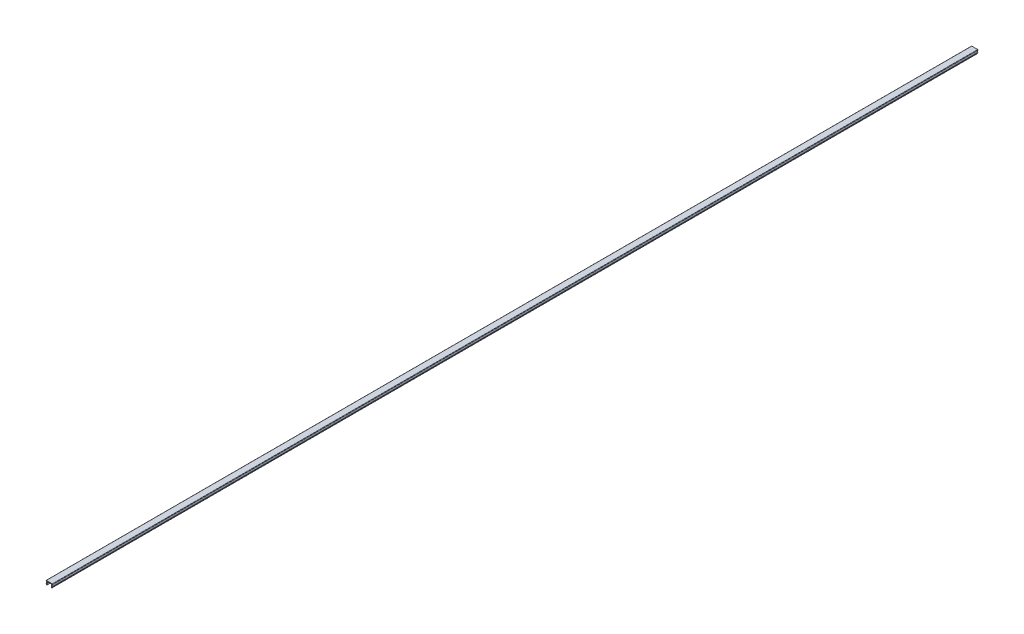
ISO-10303-21;
HEADER;
FILE_DESCRIPTION(('STEP AP214'),'2;1');
FILE_NAME('part.step','',(''),(''),'','','');
FILE_SCHEMA(('AUTOMOTIVE_DESIGN { 1 0 10303 214 1 1 1 1 }'));
ENDSEC;
DATA;
#1=APPLICATION_CONTEXT('core data for automotive mechanical design processes');
#2=APPLICATION_PROTOCOL_DEFINITION('international standard','automotive_design',2000,#1);
#3=PRODUCT_CONTEXT('',#1,'mechanical');
#4=PRODUCT('Part','Part','',(#3));
#5=PRODUCT_RELATED_PRODUCT_CATEGORY('part','',(#4));
#6=PRODUCT_DEFINITION_FORMATION('','',#4);
#7=PRODUCT_DEFINITION_CONTEXT('part definition',#1,'design');
#8=PRODUCT_DEFINITION('design','',#6,#7);
#9=PRODUCT_DEFINITION_SHAPE('','',#8);
#10=(LENGTH_UNIT() NAMED_UNIT(*) SI_UNIT(.MILLI.,.METRE.));
#11=(NAMED_UNIT(*) PLANE_ANGLE_UNIT() SI_UNIT($,.RADIAN.));
#12=(NAMED_UNIT(*) SI_UNIT($,.STERADIAN.) SOLID_ANGLE_UNIT());
#13=UNCERTAINTY_MEASURE_WITH_UNIT(LENGTH_MEASURE(1.E-05),#10,'distance_accuracy_value','');
#14=(GEOMETRIC_REPRESENTATION_CONTEXT(3) GLOBAL_UNCERTAINTY_ASSIGNED_CONTEXT((#13)) GLOBAL_UNIT_ASSIGNED_CONTEXT((#10,
#11,#12)) REPRESENTATION_CONTEXT('',''));
#15=CARTESIAN_POINT('',(0.,0.,0.));
#16=DIRECTION('',(0.,0.,1.));
#17=DIRECTION('',(1.,0.,0.));
#18=AXIS2_PLACEMENT_3D('',#15,#16,#17);
#19=CARTESIAN_POINT('',(-1.62833862518597,3.54999984480356,1000.));
#20=DIRECTION('',(0.,1.,0.));
#21=DIRECTION('',(0.,0.,1.));
#22=AXIS2_PLACEMENT_3D('',#19,#20,#21);
#23=PLANE('',#22);
#24=DIRECTION('',(0.,0.,-1.));
#25=VECTOR('',#24,1.);
#26=CARTESIAN_POINT('',(4.17268348863716,3.54999984480356,1000.));
#27=LINE('',#26,#25);
#28=CARTESIAN_POINT('',(4.17268348863716,3.54999984480356,1000.));
#29=VERTEX_POINT('',#28);
#30=CARTESIAN_POINT('',(4.17268348863716,3.54999984480356,0.));
#31=VERTEX_POINT('',#30);
#32=EDGE_CURVE('E161',#29,#31,#27,.T.);
#33=ORIENTED_EDGE('',*,*,#32,.F.);
#34=DIRECTION('',(1.,0.,0.));
#35=VECTOR('',#34,1.);
#36=CARTESIAN_POINT('',(-1.62833862518597,3.54999984480356,1000.));
#37=LINE('',#36,#35);
#38=CARTESIAN_POINT('',(-0.4293607390091,3.54999984480356,1000.));
#39=VERTEX_POINT('',#38);
#40=EDGE_CURVE('E231',#39,#29,#37,.T.);
#41=ORIENTED_EDGE('',*,*,#40,.F.);
#42=DIRECTION('',(0.,0.,-1.));
#43=VECTOR('',#42,1.);
#44=CARTESIAN_POINT('',(-0.4293607390091,3.54999984480356,1000.));
#45=LINE('',#44,#43);
#46=CARTESIAN_POINT('',(-0.4293607390091,3.54999984480356,0.));
#47=VERTEX_POINT('',#46);
#48=EDGE_CURVE('E244',#39,#47,#45,.T.);
#49=ORIENTED_EDGE('',*,*,#48,.T.);
#50=DIRECTION('',(1.,0.,0.));
#51=VECTOR('',#50,1.);
#52=CARTESIAN_POINT('',(-1.62833862518597,3.54999984480356,0.));
#53=LINE('',#52,#51);
#54=EDGE_CURVE('E239',#47,#31,#53,.T.);
#55=ORIENTED_EDGE('',*,*,#54,.T.);
#56=EDGE_LOOP('',(#33,#41,#49,#55));
#57=FACE_BOUND('',#56,.T.);
#58=ADVANCED_FACE('F15',(#57),#23,.F.);
#59=CARTESIAN_POINT('',(-1.32833862518597,3.54999984480356,1000.));
#60=VERTEX_POINT('',#59);
#61=CARTESIAN_POINT('',(-1.03981651136284,3.54999984480356,1000.));
#62=VERTEX_POINT('',#61);
#63=EDGE_CURVE('E228',#60,#62,#37,.T.);
#64=ORIENTED_EDGE('',*,*,#63,.F.);
#65=DIRECTION('',(0.,0.,-1.));
#66=VECTOR('',#65,1.);
#67=CARTESIAN_POINT('',(-1.32833862518597,3.54999984480356,0.));
#68=LINE('',#67,#66);
#69=CARTESIAN_POINT('',(-1.32833862518597,3.54999984480356,0.));
#70=VERTEX_POINT('',#69);
#71=EDGE_CURVE('E24',#60,#70,#68,.T.);
#72=ORIENTED_EDGE('',*,*,#71,.T.);
#73=CARTESIAN_POINT('',(-1.03981651136284,3.54999984480356,0.));
#74=VERTEX_POINT('',#73);
#75=EDGE_CURVE('E236',#70,#74,#53,.T.);
#76=ORIENTED_EDGE('',*,*,#75,.T.);
#77=DIRECTION('',(0.,0.,-1.));
#78=VECTOR('',#77,1.);
#79=CARTESIAN_POINT('',(-1.03981651136284,3.54999984480356,1000.));
#80=LINE('',#79,#78);
#81=EDGE_CURVE('E235',#62,#74,#80,.T.);
#82=ORIENTED_EDGE('',*,*,#81,.F.);
#83=EDGE_LOOP('',(#64,#72,#76,#82));
#84=FACE_BOUND('',#83,.T.);
#85=ADVANCED_FACE('F317',(#84),#23,.F.);
#86=CARTESIAN_POINT('',(4.7831392609909,3.54999984480356,0.));
#87=VERTEX_POINT('',#86);
#88=CARTESIAN_POINT('',(5.07166137481403,3.54999984480356,0.));
#89=VERTEX_POINT('',#88);
#90=EDGE_CURVE('E227',#87,#89,#53,.T.);
#91=ORIENTED_EDGE('',*,*,#90,.T.);
#92=DIRECTION('',(0.,0.,-1.));
#93=VECTOR('',#92,1.);
#94=CARTESIAN_POINT('',(5.07166137481403,3.54999984480356,1000.));
#95=LINE('',#94,#93);
#96=CARTESIAN_POINT('',(5.07166137481403,3.54999984480356,1000.));
#97=VERTEX_POINT('',#96);
#98=EDGE_CURVE('E9',#89,#97,#95,.F.);
#99=ORIENTED_EDGE('',*,*,#98,.T.);
#100=CARTESIAN_POINT('',(4.7831392609909,3.54999984480356,1000.));
#101=VERTEX_POINT('',#100);
#102=EDGE_CURVE('E232',#101,#97,#37,.T.);
#103=ORIENTED_EDGE('',*,*,#102,.F.);
#104=DIRECTION('',(0.,0.,-1.));
#105=VECTOR('',#104,1.);
#106=CARTESIAN_POINT('',(4.7831392609909,3.54999984480356,1000.));
#107=LINE('',#106,#105);
#108=EDGE_CURVE('E190',#101,#87,#107,.T.);
#109=ORIENTED_EDGE('',*,*,#108,.T.);
#110=EDGE_LOOP('',(#91,#99,#103,#109));
#111=FACE_BOUND('',#110,.T.);
#112=ADVANCED_FACE('F286',(#111),#23,.F.);
#113=CARTESIAN_POINT('',(-1.62833862518597,4.14999984480356,1000.));
#114=DIRECTION('',(0.,1.,0.));
#115=DIRECTION('',(0.,0.,1.));
#116=AXIS2_PLACEMENT_3D('',#113,#114,#115);
#117=PLANE('',#116);
#118=DIRECTION('',(1.,0.,0.));
#119=VECTOR('',#118,1.);
#120=CARTESIAN_POINT('',(-1.62833862518597,4.14999984480356,0.));
#121=LINE('',#120,#119);
#122=CARTESIAN_POINT('',(-1.32833862518597,4.14999984480356,0.));
#123=VERTEX_POINT('',#122);
#124=CARTESIAN_POINT('',(5.07166137481403,4.14999984480356,0.));
#125=VERTEX_POINT('',#124);
#126=EDGE_CURVE('E238',#123,#125,#121,.T.);
#127=ORIENTED_EDGE('',*,*,#126,.F.);
#128=DIRECTION('',(0.,0.,-1.));
#129=VECTOR('',#128,1.);
#130=CARTESIAN_POINT('',(-1.32833862518597,4.14999984480356,1000.));
#131=LINE('',#130,#129);
#132=CARTESIAN_POINT('',(-1.32833862518597,4.14999984480356,1000.));
#133=VERTEX_POINT('',#132);
#134=EDGE_CURVE('E257',#123,#133,#131,.F.);
#135=ORIENTED_EDGE('',*,*,#134,.T.);
#136=DIRECTION('',(1.,0.,0.));
#137=VECTOR('',#136,1.);
#138=CARTESIAN_POINT('',(-1.62833862518597,4.14999984480356,1000.));
#139=LINE('',#138,#137);
#140=CARTESIAN_POINT('',(5.07166137481403,4.14999984480356,1000.));
#141=VERTEX_POINT('',#140);
#142=EDGE_CURVE('E230',#133,#141,#139,.T.);
#143=ORIENTED_EDGE('',*,*,#142,.T.);
#144=DIRECTION('',(0.,0.,-1.));
#145=VECTOR('',#144,1.);
#146=CARTESIAN_POINT('',(5.07166137481403,4.14999984480356,1000.));
#147=LINE('',#146,#145);
#148=EDGE_CURVE('E254',#141,#125,#147,.T.);
#149=ORIENTED_EDGE('',*,*,#148,.T.);
#150=EDGE_LOOP('',(#127,#135,#143,#149));
#151=FACE_BOUND('',#150,.T.);
#152=ADVANCED_FACE('F326',(#151),#117,.T.);
#153=CARTESIAN_POINT('',(0.,0.,1000.));
#154=DIRECTION('',(0.,0.,-1.));
#155=DIRECTION('',(-1.,0.,0.));
#156=AXIS2_PLACEMENT_3D('',#153,#154,#155);
#157=PLANE('',#156);
#158=ORIENTED_EDGE('',*,*,#142,.F.);
#159=CARTESIAN_POINT('',(-1.32833862518597,3.84999984480356,1000.));
#160=DIRECTION('',(0.,0.,-1.));
#161=DIRECTION('',(-1.,0.,0.));
#162=AXIS2_PLACEMENT_3D('',#159,#160,#161);
#163=CIRCLE('',#162,0.3);
#164=CARTESIAN_POINT('',(-1.62833862518597,3.84999984480356,1000.));
#165=VERTEX_POINT('',#164);
#166=EDGE_CURVE('E37',#133,#165,#163,.F.);
#167=ORIENTED_EDGE('',*,*,#166,.T.);
#168=CARTESIAN_POINT('',(-1.32833862518597,3.84999984480356,1000.));
#169=DIRECTION('',(0.,0.,-1.));
#170=DIRECTION('',(-1.,0.,0.));
#171=AXIS2_PLACEMENT_3D('',#168,#169,#170);
#172=CIRCLE('',#171,0.3);
#173=EDGE_CURVE('E32',#165,#60,#172,.F.);
#174=ORIENTED_EDGE('',*,*,#173,.T.);
#175=ORIENTED_EDGE('',*,*,#63,.T.);
#176=DIRECTION('',(-0.184288535050186,-0.982872186934322,0.));
#177=VECTOR('',#176,1.);
#178=CARTESIAN_POINT('',(-0.973200281266266,3.90528640531861,1000.));
#179=LINE('',#178,#177);
#180=CARTESIAN_POINT('',(-1.43752646810523,1.42888007551082,1000.));
#181=VERTEX_POINT('',#180);
#182=EDGE_CURVE('E204',#62,#181,#179,.T.);
#183=ORIENTED_EDGE('',*,*,#182,.T.);
#184=DIRECTION('',(0.316227766016838,-0.948683298050514,0.));
#185=VECTOR('',#184,1.);
#186=CARTESIAN_POINT('',(-1.41294361460112,1.35513151499851,1000.));
#187=LINE('',#186,#185);
#188=CARTESIAN_POINT('',(-1.01294361460112,0.155131514998506,1000.));
#189=VERTEX_POINT('',#188);
#190=EDGE_CURVE('E193',#181,#189,#187,.T.);
#191=ORIENTED_EDGE('',*,*,#190,.T.);
#192=DIRECTION('',(-0.948683298050514,-0.316227766016838,0.));
#193=VECTOR('',#192,1.);
#194=CARTESIAN_POINT('',(-0.443733635770816,0.344868174608609,1000.));
#195=LINE('',#194,#193);
#196=CARTESIAN_POINT('',(-0.443733635770816,0.344868174608609,1000.));
#197=VERTEX_POINT('',#196);
#198=EDGE_CURVE('E195',#197,#189,#195,.T.);
#199=ORIENTED_EDGE('',*,*,#198,.F.);
#200=DIRECTION('',(0.316227766016838,-0.948683298050514,0.));
#201=VECTOR('',#200,1.);
#202=CARTESIAN_POINT('',(-0.843733635770816,1.54486817460861,1000.));
#203=LINE('',#202,#201);
#204=CARTESIAN_POINT('',(-0.819150782266712,1.4711196140963,1000.));
#205=VERTEX_POINT('',#204);
#206=EDGE_CURVE('E199',#205,#197,#203,.T.);
#207=ORIENTED_EDGE('',*,*,#206,.F.);
#208=DIRECTION('',(-0.184288535050186,-0.982872186934322,0.));
#209=VECTOR('',#208,1.);
#210=CARTESIAN_POINT('',(-0.383476969105673,3.7947132842885,1000.));
#211=LINE('',#210,#209);
#212=EDGE_CURVE('E202',#39,#205,#211,.T.);
#213=ORIENTED_EDGE('',*,*,#212,.F.);
#214=ORIENTED_EDGE('',*,*,#40,.T.);
#215=DIRECTION('',(0.184288535050186,-0.982872186934322,0.));
#216=VECTOR('',#215,1.);
#217=CARTESIAN_POINT('',(4.12679971873373,3.7947132842885,1000.));
#218=LINE('',#217,#216);
#219=CARTESIAN_POINT('',(4.56247353189477,1.4711196140963,1000.));
#220=VERTEX_POINT('',#219);
#221=EDGE_CURVE('E147',#29,#220,#218,.T.);
#222=ORIENTED_EDGE('',*,*,#221,.T.);
#223=DIRECTION('',(-0.316227766016838,-0.948683298050514,0.));
#224=VECTOR('',#223,1.);
#225=CARTESIAN_POINT('',(4.58705638539888,1.54486817460861,1000.));
#226=LINE('',#225,#224);
#227=CARTESIAN_POINT('',(4.18705638539888,0.34486817460861,1000.));
#228=VERTEX_POINT('',#227);
#229=EDGE_CURVE('E138',#220,#228,#226,.T.);
#230=ORIENTED_EDGE('',*,*,#229,.T.);
#231=DIRECTION('',(-0.948683298050514,0.316227766016838,0.));
#232=VECTOR('',#231,1.);
#233=CARTESIAN_POINT('',(4.75626636422918,0.155131514998507,1000.));
#234=LINE('',#233,#232);
#235=CARTESIAN_POINT('',(4.75626636422918,0.155131514998507,1000.));
#236=VERTEX_POINT('',#235);
#237=EDGE_CURVE('E143',#236,#228,#234,.T.);
#238=ORIENTED_EDGE('',*,*,#237,.F.);
#239=DIRECTION('',(-0.316227766016838,-0.948683298050514,0.));
#240=VECTOR('',#239,1.);
#241=CARTESIAN_POINT('',(5.15626636422918,1.35513151499851,1000.));
#242=LINE('',#241,#240);
#243=CARTESIAN_POINT('',(5.18084921773329,1.42888007551082,1000.));
#244=VERTEX_POINT('',#243);
#245=EDGE_CURVE('E165',#244,#236,#242,.T.);
#246=ORIENTED_EDGE('',*,*,#245,.F.);
#247=DIRECTION('',(0.184288535050186,-0.982872186934322,0.));
#248=VECTOR('',#247,1.);
#249=CARTESIAN_POINT('',(4.71652303089433,3.90528640531861,1000.));
#250=LINE('',#249,#248);
#251=EDGE_CURVE('E167',#101,#244,#250,.T.);
#252=ORIENTED_EDGE('',*,*,#251,.F.);
#253=ORIENTED_EDGE('',*,*,#102,.T.);
#254=CARTESIAN_POINT('',(5.07166137481403,3.84999984480356,1000.));
#255=DIRECTION('',(0.,0.,-1.));
#256=DIRECTION('',(-1.,0.,0.));
#257=AXIS2_PLACEMENT_3D('',#254,#255,#256);
#258=CIRCLE('',#257,0.3);
#259=CARTESIAN_POINT('',(5.37166137481403,3.84999984480356,1000.));
#260=VERTEX_POINT('',#259);
#261=EDGE_CURVE('E260',#97,#260,#258,.F.);
#262=ORIENTED_EDGE('',*,*,#261,.T.);
#263=CARTESIAN_POINT('',(5.07166137481403,3.84999984480356,1000.));
#264=DIRECTION('',(0.,0.,-1.));
#265=DIRECTION('',(-1.,0.,0.));
#266=AXIS2_PLACEMENT_3D('',#263,#264,#265);
#267=CIRCLE('',#266,0.3);
#268=EDGE_CURVE('E262',#260,#141,#267,.F.);
#269=ORIENTED_EDGE('',*,*,#268,.T.);
#270=EDGE_LOOP('',(#158,#167,#174,#175,#183,#191,#199,#207,#213,#214,#222,#230,#238,#246,#252,
#253,#262,#269));
#271=FACE_BOUND('',#270,.T.);
#272=ADVANCED_FACE('F140',(#271),#157,.F.);
#273=CARTESIAN_POINT('',(0.,0.,0.));
#274=DIRECTION('',(0.,0.,-1.));
#275=DIRECTION('',(-1.,0.,0.));
#276=AXIS2_PLACEMENT_3D('',#273,#274,#275);
#277=PLANE('',#276);
#278=CARTESIAN_POINT('',(-1.32833862518597,3.84999984480356,0.));
#279=DIRECTION('',(0.,0.,-1.));
#280=DIRECTION('',(-1.,0.,0.));
#281=AXIS2_PLACEMENT_3D('',#278,#279,#280);
#282=CIRCLE('',#281,0.3);
#283=CARTESIAN_POINT('',(-1.62833862518597,3.84999984480356,0.));
#284=VERTEX_POINT('',#283);
#285=EDGE_CURVE('E250',#70,#284,#282,.T.);
#286=ORIENTED_EDGE('',*,*,#285,.T.);
#287=CARTESIAN_POINT('',(-1.32833862518597,3.84999984480356,0.));
#288=DIRECTION('',(0.,0.,-1.));
#289=DIRECTION('',(-1.,0.,0.));
#290=AXIS2_PLACEMENT_3D('',#287,#288,#289);
#291=CIRCLE('',#290,0.3);
#292=EDGE_CURVE('E252',#284,#123,#291,.T.);
#293=ORIENTED_EDGE('',*,*,#292,.T.);
#294=ORIENTED_EDGE('',*,*,#126,.T.);
#295=CARTESIAN_POINT('',(5.07166137481403,3.84999984480356,0.));
#296=DIRECTION('',(0.,0.,-1.));
#297=DIRECTION('',(-1.,0.,0.));
#298=AXIS2_PLACEMENT_3D('',#295,#296,#297);
#299=CIRCLE('',#298,0.3);
#300=CARTESIAN_POINT('',(5.37166137481403,3.84999984480356,0.));
#301=VERTEX_POINT('',#300);
#302=EDGE_CURVE('E248',#125,#301,#299,.T.);
#303=ORIENTED_EDGE('',*,*,#302,.T.);
#304=CARTESIAN_POINT('',(5.07166137481403,3.84999984480356,0.));
#305=DIRECTION('',(0.,0.,-1.));
#306=DIRECTION('',(-1.,0.,0.));
#307=AXIS2_PLACEMENT_3D('',#304,#305,#306);
#308=CIRCLE('',#307,0.3);
#309=EDGE_CURVE('E246',#301,#89,#308,.T.);
#310=ORIENTED_EDGE('',*,*,#309,.T.);
#311=ORIENTED_EDGE('',*,*,#90,.F.);
#312=DIRECTION('',(0.184288535050186,-0.982872186934322,0.));
#313=VECTOR('',#312,1.);
#314=CARTESIAN_POINT('',(4.71652303089433,3.90528640531861,0.));
#315=LINE('',#314,#313);
#316=CARTESIAN_POINT('',(5.18084921773329,1.42888007551082,0.));
#317=VERTEX_POINT('',#316);
#318=EDGE_CURVE('E180',#87,#317,#315,.T.);
#319=ORIENTED_EDGE('',*,*,#318,.T.);
#320=DIRECTION('',(-0.316227766016838,-0.948683298050514,0.));
#321=VECTOR('',#320,1.);
#322=CARTESIAN_POINT('',(5.15626636422918,1.35513151499851,0.));
#323=LINE('',#322,#321);
#324=CARTESIAN_POINT('',(4.75626636422918,0.155131514998507,0.));
#325=VERTEX_POINT('',#324);
#326=EDGE_CURVE('E177',#317,#325,#323,.T.);
#327=ORIENTED_EDGE('',*,*,#326,.T.);
#328=DIRECTION('',(-0.948683298050514,0.316227766016838,0.));
#329=VECTOR('',#328,1.);
#330=CARTESIAN_POINT('',(4.75626636422918,0.155131514998507,0.));
#331=LINE('',#330,#329);
#332=CARTESIAN_POINT('',(4.18705638539888,0.34486817460861,0.));
#333=VERTEX_POINT('',#332);
#334=EDGE_CURVE('E174',#325,#333,#331,.T.);
#335=ORIENTED_EDGE('',*,*,#334,.T.);
#336=DIRECTION('',(-0.316227766016838,-0.948683298050514,0.));
#337=VECTOR('',#336,1.);
#338=CARTESIAN_POINT('',(4.58705638539888,1.54486817460861,0.));
#339=LINE('',#338,#337);
#340=CARTESIAN_POINT('',(4.56247353189477,1.4711196140963,0.));
#341=VERTEX_POINT('',#340);
#342=EDGE_CURVE('E157',#341,#333,#339,.T.);
#343=ORIENTED_EDGE('',*,*,#342,.F.);
#344=DIRECTION('',(0.184288535050186,-0.982872186934322,0.));
#345=VECTOR('',#344,1.);
#346=CARTESIAN_POINT('',(4.12679971873373,3.7947132842885,0.));
#347=LINE('',#346,#345);
#348=EDGE_CURVE('E151',#31,#341,#347,.T.);
#349=ORIENTED_EDGE('',*,*,#348,.F.);
#350=ORIENTED_EDGE('',*,*,#54,.F.);
#351=DIRECTION('',(-0.184288535050186,-0.982872186934322,0.));
#352=VECTOR('',#351,1.);
#353=CARTESIAN_POINT('',(-0.383476969105673,3.7947132842885,0.));
#354=LINE('',#353,#352);
#355=CARTESIAN_POINT('',(-0.819150782266712,1.4711196140963,0.));
#356=VERTEX_POINT('',#355);
#357=EDGE_CURVE('E215',#47,#356,#354,.T.);
#358=ORIENTED_EDGE('',*,*,#357,.T.);
#359=DIRECTION('',(0.316227766016838,-0.948683298050514,0.));
#360=VECTOR('',#359,1.);
#361=CARTESIAN_POINT('',(-0.843733635770816,1.54486817460861,0.));
#362=LINE('',#361,#360);
#363=CARTESIAN_POINT('',(-0.443733635770816,0.344868174608609,0.));
#364=VERTEX_POINT('',#363);
#365=EDGE_CURVE('E212',#356,#364,#362,.T.);
#366=ORIENTED_EDGE('',*,*,#365,.T.);
#367=DIRECTION('',(-0.948683298050514,-0.316227766016838,0.));
#368=VECTOR('',#367,1.);
#369=CARTESIAN_POINT('',(-0.443733635770816,0.344868174608609,0.));
#370=LINE('',#369,#368);
#371=CARTESIAN_POINT('',(-1.01294361460112,0.155131514998506,0.));
#372=VERTEX_POINT('',#371);
#373=EDGE_CURVE('E209',#364,#372,#370,.T.);
#374=ORIENTED_EDGE('',*,*,#373,.T.);
#375=DIRECTION('',(0.316227766016838,-0.948683298050514,0.));
#376=VECTOR('',#375,1.);
#377=CARTESIAN_POINT('',(-1.41294361460112,1.35513151499851,0.));
#378=LINE('',#377,#376);
#379=CARTESIAN_POINT('',(-1.43752646810523,1.42888007551082,0.));
#380=VERTEX_POINT('',#379);
#381=EDGE_CURVE('E192',#380,#372,#378,.T.);
#382=ORIENTED_EDGE('',*,*,#381,.F.);
#383=DIRECTION('',(-0.184288535050186,-0.982872186934322,0.));
#384=VECTOR('',#383,1.);
#385=CARTESIAN_POINT('',(-0.973200281266266,3.90528640531861,0.));
#386=LINE('',#385,#384);
#387=EDGE_CURVE('E196',#74,#380,#386,.T.);
#388=ORIENTED_EDGE('',*,*,#387,.F.);
#389=ORIENTED_EDGE('',*,*,#75,.F.);
#390=EDGE_LOOP('',(#286,#293,#294,#303,#310,#311,#319,#327,#335,#343,#349,#350,#358,#366,#374,
#382,#388,#389));
#391=FACE_BOUND('',#390,.T.);
#392=ADVANCED_FACE('F283',(#391),#277,.T.);
#393=CARTESIAN_POINT('',(-0.383476969105673,3.7947132842885,1000.));
#394=DIRECTION('',(0.982872186934322,-0.184288535050186,0.));
#395=DIRECTION('',(0.184288535050186,0.982872186934322,0.));
#396=AXIS2_PLACEMENT_3D('',#393,#394,#395);
#397=PLANE('',#396);
#398=ORIENTED_EDGE('',*,*,#48,.F.);
#399=ORIENTED_EDGE('',*,*,#212,.T.);
#400=DIRECTION('',(0.,0.,-1.));
#401=VECTOR('',#400,1.);
#402=CARTESIAN_POINT('',(-0.819150782266712,1.4711196140963,1000.));
#403=LINE('',#402,#401);
#404=EDGE_CURVE('E220',#205,#356,#403,.T.);
#405=ORIENTED_EDGE('',*,*,#404,.T.);
#406=ORIENTED_EDGE('',*,*,#357,.F.);
#407=EDGE_LOOP('',(#398,#399,#405,#406));
#408=FACE_BOUND('',#407,.T.);
#409=ADVANCED_FACE('F338',(#408),#397,.T.);
#410=CARTESIAN_POINT('',(-0.973200281266266,3.90528640531861,1000.));
#411=DIRECTION('',(0.982872186934322,-0.184288535050186,0.));
#412=DIRECTION('',(0.184288535050186,0.982872186934322,0.));
#413=AXIS2_PLACEMENT_3D('',#410,#411,#412);
#414=PLANE('',#413);
#415=ORIENTED_EDGE('',*,*,#182,.F.);
#416=ORIENTED_EDGE('',*,*,#81,.T.);
#417=ORIENTED_EDGE('',*,*,#387,.T.);
#418=DIRECTION('',(0.,0.,-1.));
#419=VECTOR('',#418,1.);
#420=CARTESIAN_POINT('',(-1.43752646810523,1.42888007551082,1000.));
#421=LINE('',#420,#419);
#422=EDGE_CURVE('E206',#181,#380,#421,.T.);
#423=ORIENTED_EDGE('',*,*,#422,.F.);
#424=EDGE_LOOP('',(#415,#416,#417,#423));
#425=FACE_BOUND('',#424,.T.);
#426=ADVANCED_FACE('F343',(#425),#414,.F.);
#427=CARTESIAN_POINT('',(-1.41294361460112,1.35513151499851,1000.));
#428=DIRECTION('',(0.948683298050514,0.316227766016838,0.));
#429=DIRECTION('',(-0.316227766016838,0.948683298050514,0.));
#430=AXIS2_PLACEMENT_3D('',#427,#428,#429);
#431=PLANE('',#430);
#432=ORIENTED_EDGE('',*,*,#381,.T.);
#433=DIRECTION('',(0.,0.,-1.));
#434=VECTOR('',#433,1.);
#435=CARTESIAN_POINT('',(-1.01294361460112,0.155131514998506,1000.));
#436=LINE('',#435,#434);
#437=EDGE_CURVE('E225',#189,#372,#436,.T.);
#438=ORIENTED_EDGE('',*,*,#437,.F.);
#439=ORIENTED_EDGE('',*,*,#190,.F.);
#440=ORIENTED_EDGE('',*,*,#422,.T.);
#441=EDGE_LOOP('',(#432,#438,#439,#440));
#442=FACE_BOUND('',#441,.T.);
#443=ADVANCED_FACE('F340',(#442),#431,.F.);
#444=CARTESIAN_POINT('',(-0.443733635770816,0.344868174608609,1000.));
#445=DIRECTION('',(0.316227766016838,-0.948683298050514,0.));
#446=DIRECTION('',(0.948683298050514,0.316227766016838,0.));
#447=AXIS2_PLACEMENT_3D('',#444,#445,#446);
#448=PLANE('',#447);
#449=ORIENTED_EDGE('',*,*,#373,.F.);
#450=DIRECTION('',(0.,0.,-1.));
#451=VECTOR('',#450,1.);
#452=CARTESIAN_POINT('',(-0.443733635770816,0.344868174608609,1000.));
#453=LINE('',#452,#451);
#454=EDGE_CURVE('E223',#197,#364,#453,.T.);
#455=ORIENTED_EDGE('',*,*,#454,.F.);
#456=ORIENTED_EDGE('',*,*,#198,.T.);
#457=ORIENTED_EDGE('',*,*,#437,.T.);
#458=EDGE_LOOP('',(#449,#455,#456,#457));
#459=FACE_BOUND('',#458,.T.);
#460=ADVANCED_FACE('F312',(#459),#448,.T.);
#461=CARTESIAN_POINT('',(-0.843733635770816,1.54486817460861,1000.));
#462=DIRECTION('',(0.948683298050514,0.316227766016838,0.));
#463=DIRECTION('',(-0.316227766016838,0.948683298050514,0.));
#464=AXIS2_PLACEMENT_3D('',#461,#462,#463);
#465=PLANE('',#464);
#466=ORIENTED_EDGE('',*,*,#365,.F.);
#467=ORIENTED_EDGE('',*,*,#404,.F.);
#468=ORIENTED_EDGE('',*,*,#206,.T.);
#469=ORIENTED_EDGE('',*,*,#454,.T.);
#470=EDGE_LOOP('',(#466,#467,#468,#469));
#471=FACE_BOUND('',#470,.T.);
#472=ADVANCED_FACE('F304',(#471),#465,.T.);
#473=CARTESIAN_POINT('',(4.71652303089433,3.90528640531861,1000.));
#474=DIRECTION('',(0.982872186934322,0.184288535050186,0.));
#475=DIRECTION('',(-0.184288535050186,0.982872186934322,0.));
#476=AXIS2_PLACEMENT_3D('',#473,#474,#475);
#477=PLANE('',#476);
#478=ORIENTED_EDGE('',*,*,#108,.F.);
#479=ORIENTED_EDGE('',*,*,#251,.T.);
#480=DIRECTION('',(0.,0.,-1.));
#481=VECTOR('',#480,1.);
#482=CARTESIAN_POINT('',(5.18084921773329,1.42888007551082,1000.));
#483=LINE('',#482,#481);
#484=EDGE_CURVE('E184',#244,#317,#483,.T.);
#485=ORIENTED_EDGE('',*,*,#484,.T.);
#486=ORIENTED_EDGE('',*,*,#318,.F.);
#487=EDGE_LOOP('',(#478,#479,#485,#486));
#488=FACE_BOUND('',#487,.T.);
#489=ADVANCED_FACE('F302',(#488),#477,.T.);
#490=CARTESIAN_POINT('',(4.12679971873373,3.7947132842885,1000.));
#491=DIRECTION('',(0.982872186934322,0.184288535050186,0.));
#492=DIRECTION('',(-0.184288535050186,0.982872186934322,0.));
#493=AXIS2_PLACEMENT_3D('',#490,#491,#492);
#494=PLANE('',#493);
#495=ORIENTED_EDGE('',*,*,#221,.F.);
#496=ORIENTED_EDGE('',*,*,#32,.T.);
#497=ORIENTED_EDGE('',*,*,#348,.T.);
#498=DIRECTION('',(0.,0.,-1.));
#499=VECTOR('',#498,1.);
#500=CARTESIAN_POINT('',(4.56247353189477,1.4711196140963,1000.));
#501=LINE('',#500,#499);
#502=EDGE_CURVE('E172',#220,#341,#501,.T.);
#503=ORIENTED_EDGE('',*,*,#502,.F.);
#504=EDGE_LOOP('',(#495,#496,#497,#503));
#505=FACE_BOUND('',#504,.T.);
#506=ADVANCED_FACE('F295',(#505),#494,.F.);
#507=CARTESIAN_POINT('',(4.58705638539888,1.54486817460861,1000.));
#508=DIRECTION('',(0.948683298050514,-0.316227766016838,0.));
#509=DIRECTION('',(0.316227766016838,0.948683298050514,0.));
#510=AXIS2_PLACEMENT_3D('',#507,#508,#509);
#511=PLANE('',#510);
#512=ORIENTED_EDGE('',*,*,#342,.T.);
#513=DIRECTION('',(0.,0.,-1.));
#514=VECTOR('',#513,1.);
#515=CARTESIAN_POINT('',(4.18705638539888,0.34486817460861,1000.));
#516=LINE('',#515,#514);
#517=EDGE_CURVE('E154',#228,#333,#516,.T.);
#518=ORIENTED_EDGE('',*,*,#517,.F.);
#519=ORIENTED_EDGE('',*,*,#229,.F.);
#520=ORIENTED_EDGE('',*,*,#502,.T.);
#521=EDGE_LOOP('',(#512,#518,#519,#520));
#522=FACE_BOUND('',#521,.T.);
#523=ADVANCED_FACE('F155',(#522),#511,.F.);
#524=CARTESIAN_POINT('',(4.75626636422918,0.155131514998507,1000.));
#525=DIRECTION('',(-0.316227766016838,-0.948683298050514,0.));
#526=DIRECTION('',(0.948683298050514,-0.316227766016838,0.));
#527=AXIS2_PLACEMENT_3D('',#524,#525,#526);
#528=PLANE('',#527);
#529=ORIENTED_EDGE('',*,*,#334,.F.);
#530=DIRECTION('',(0.,0.,-1.));
#531=VECTOR('',#530,1.);
#532=CARTESIAN_POINT('',(4.75626636422918,0.155131514998507,1000.));
#533=LINE('',#532,#531);
#534=EDGE_CURVE('E162',#236,#325,#533,.T.);
#535=ORIENTED_EDGE('',*,*,#534,.F.);
#536=ORIENTED_EDGE('',*,*,#237,.T.);
#537=ORIENTED_EDGE('',*,*,#517,.T.);
#538=EDGE_LOOP('',(#529,#535,#536,#537));
#539=FACE_BOUND('',#538,.T.);
#540=ADVANCED_FACE('F164',(#539),#528,.T.);
#541=CARTESIAN_POINT('',(5.15626636422918,1.35513151499851,1000.));
#542=DIRECTION('',(0.948683298050514,-0.316227766016838,0.));
#543=DIRECTION('',(0.316227766016838,0.948683298050514,0.));
#544=AXIS2_PLACEMENT_3D('',#541,#542,#543);
#545=PLANE('',#544);
#546=ORIENTED_EDGE('',*,*,#326,.F.);
#547=ORIENTED_EDGE('',*,*,#484,.F.);
#548=ORIENTED_EDGE('',*,*,#245,.T.);
#549=ORIENTED_EDGE('',*,*,#534,.T.);
#550=EDGE_LOOP('',(#546,#547,#548,#549));
#551=FACE_BOUND('',#550,.T.);
#552=ADVANCED_FACE('F299',(#551),#545,.T.);
#553=CARTESIAN_POINT('',(-1.32833862518597,3.84999984480356,1000.));
#554=DIRECTION('',(0.,0.,1.));
#555=DIRECTION('',(1.,0.,0.));
#556=AXIS2_PLACEMENT_3D('',#553,#554,#555);
#557=CYLINDRICAL_SURFACE('',#556,0.3);
#558=ORIENTED_EDGE('',*,*,#71,.F.);
#559=ORIENTED_EDGE('',*,*,#173,.F.);
#560=DIRECTION('',(0.,0.,-1.));
#561=VECTOR('',#560,1.);
#562=CARTESIAN_POINT('',(-1.62833862518597,3.84999984480356,1000.));
#563=LINE('',#562,#561);
#564=EDGE_CURVE('E175',#284,#165,#563,.F.);
#565=ORIENTED_EDGE('',*,*,#564,.F.);
#566=ORIENTED_EDGE('',*,*,#285,.F.);
#567=EDGE_LOOP('',(#558,#559,#565,#566));
#568=FACE_BOUND('',#567,.T.);
#569=ADVANCED_FACE('F358',(#568),#557,.T.);
#570=CARTESIAN_POINT('',(-1.32833862518597,3.84999984480356,1000.));
#571=DIRECTION('',(0.,0.,-1.));
#572=DIRECTION('',(-1.,0.,0.));
#573=AXIS2_PLACEMENT_3D('',#570,#571,#572);
#574=CYLINDRICAL_SURFACE('',#573,0.3);
#575=ORIENTED_EDGE('',*,*,#166,.F.);
#576=ORIENTED_EDGE('',*,*,#134,.F.);
#577=ORIENTED_EDGE('',*,*,#292,.F.);
#578=ORIENTED_EDGE('',*,*,#564,.T.);
#579=EDGE_LOOP('',(#575,#576,#577,#578));
#580=FACE_BOUND('',#579,.T.);
#581=ADVANCED_FACE('F362',(#580),#574,.T.);
#582=CARTESIAN_POINT('',(5.07166137481403,3.84999984480356,1000.));
#583=DIRECTION('',(0.,0.,1.));
#584=DIRECTION('',(1.,0.,0.));
#585=AXIS2_PLACEMENT_3D('',#582,#583,#584);
#586=CYLINDRICAL_SURFACE('',#585,0.3);
#587=DIRECTION('',(0.,0.,-1.));
#588=VECTOR('',#587,1.);
#589=CARTESIAN_POINT('',(5.37166137481403,3.84999984480356,0.));
#590=LINE('',#589,#588);
#591=EDGE_CURVE('E19',#260,#301,#590,.T.);
#592=ORIENTED_EDGE('',*,*,#591,.F.);
#593=ORIENTED_EDGE('',*,*,#261,.F.);
#594=ORIENTED_EDGE('',*,*,#98,.F.);
#595=ORIENTED_EDGE('',*,*,#309,.F.);
#596=EDGE_LOOP('',(#592,#593,#594,#595));
#597=FACE_BOUND('',#596,.T.);
#598=ADVANCED_FACE('F17',(#597),#586,.T.);
#599=CARTESIAN_POINT('',(5.07166137481403,3.84999984480356,1000.));
#600=DIRECTION('',(0.,0.,-1.));
#601=DIRECTION('',(-1.,0.,0.));
#602=AXIS2_PLACEMENT_3D('',#599,#600,#601);
#603=CYLINDRICAL_SURFACE('',#602,0.3);
#604=ORIENTED_EDGE('',*,*,#268,.F.);
#605=ORIENTED_EDGE('',*,*,#591,.T.);
#606=ORIENTED_EDGE('',*,*,#302,.F.);
#607=ORIENTED_EDGE('',*,*,#148,.F.);
#608=EDGE_LOOP('',(#604,#605,#606,#607));
#609=FACE_BOUND('',#608,.T.);
#610=ADVANCED_FACE('F274',(#609),#603,.T.);
#611=CLOSED_SHELL('',(#58,#85,#112,#152,#272,#392,#409,#426,#443,#460,#472,#489,#506,#523,#540,
#552,#569,#581,#598,#610));
#612=MANIFOLD_SOLID_BREP('B1',#611);
#613=ADVANCED_BREP_SHAPE_REPRESENTATION('',(#18,#612),#14);
#614=SHAPE_DEFINITION_REPRESENTATION(#9,#613);
ENDSEC;
END-ISO-10303-21;
